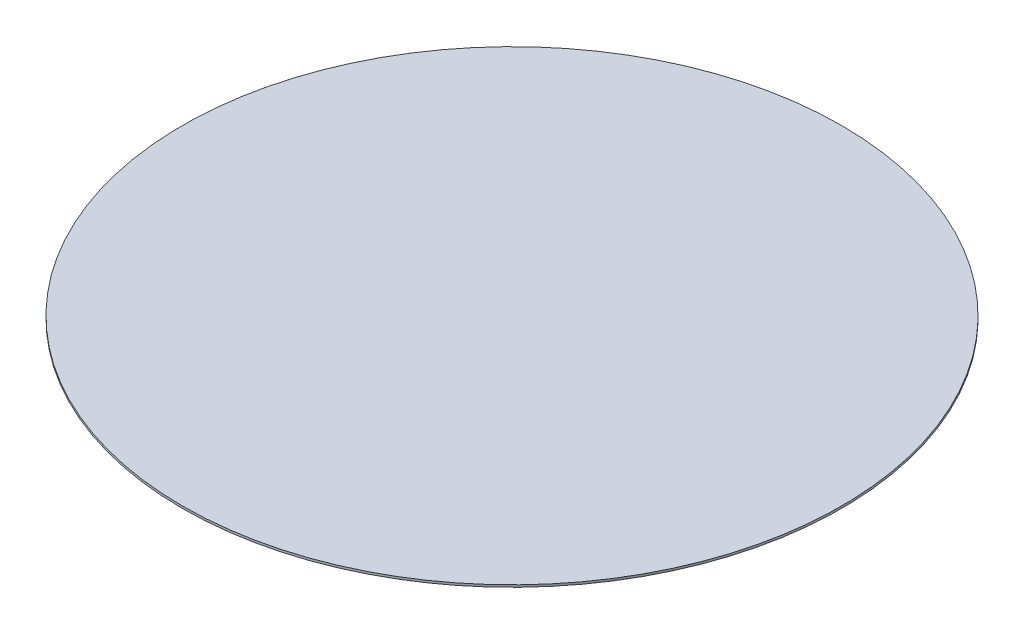
ISO-10303-21;
HEADER;
FILE_DESCRIPTION(('STEP AP214'),'2;1');
FILE_NAME('part.step','',(''),(''),'','','');
FILE_SCHEMA(('AUTOMOTIVE_DESIGN { 1 0 10303 214 1 1 1 1 }'));
ENDSEC;
DATA;
#1=APPLICATION_CONTEXT('core data for automotive mechanical design processes');
#2=APPLICATION_PROTOCOL_DEFINITION('international standard','automotive_design',2000,#1);
#3=PRODUCT_CONTEXT('',#1,'mechanical');
#4=PRODUCT('Part','Part','',(#3));
#5=PRODUCT_RELATED_PRODUCT_CATEGORY('part','',(#4));
#6=PRODUCT_DEFINITION_FORMATION('','',#4);
#7=PRODUCT_DEFINITION_CONTEXT('part definition',#1,'design');
#8=PRODUCT_DEFINITION('design','',#6,#7);
#9=PRODUCT_DEFINITION_SHAPE('','',#8);
#10=(LENGTH_UNIT() NAMED_UNIT(*) SI_UNIT(.MILLI.,.METRE.));
#11=(NAMED_UNIT(*) PLANE_ANGLE_UNIT() SI_UNIT($,.RADIAN.));
#12=(NAMED_UNIT(*) SI_UNIT($,.STERADIAN.) SOLID_ANGLE_UNIT());
#13=UNCERTAINTY_MEASURE_WITH_UNIT(LENGTH_MEASURE(1.E-05),#10,'distance_accuracy_value','');
#14=(GEOMETRIC_REPRESENTATION_CONTEXT(3) GLOBAL_UNCERTAINTY_ASSIGNED_CONTEXT((#13)) GLOBAL_UNIT_ASSIGNED_CONTEXT((#10,
#11,#12)) REPRESENTATION_CONTEXT('',''));
#15=CARTESIAN_POINT('',(0.,0.,0.));
#16=DIRECTION('',(0.,0.,1.));
#17=DIRECTION('',(1.,0.,0.));
#18=AXIS2_PLACEMENT_3D('',#15,#16,#17);
#19=CARTESIAN_POINT('',(0.,1.,0.));
#20=DIRECTION('',(0.,-1.,0.));
#21=DIRECTION('',(0.,0.,-1.));
#22=AXIS2_PLACEMENT_3D('',#19,#20,#21);
#23=CYLINDRICAL_SURFACE('',#22,150.);
#24=CARTESIAN_POINT('',(0.,1.,0.));
#25=DIRECTION('',(0.,1.,0.));
#26=DIRECTION('',(0.,0.,1.));
#27=AXIS2_PLACEMENT_3D('',#24,#25,#26);
#28=CIRCLE('',#27,150.);
#29=CARTESIAN_POINT('',(0.,1.,150.));
#30=VERTEX_POINT('',#29);
#31=EDGE_CURVE('E10',#30,#30,#28,.T.);
#32=ORIENTED_EDGE('',*,*,#31,.F.);
#33=EDGE_LOOP('',(#32));
#34=FACE_BOUND('',#33,.T.);
#35=CARTESIAN_POINT('',(0.,0.,0.));
#36=DIRECTION('',(0.,1.,0.));
#37=DIRECTION('',(0.,0.,1.));
#38=AXIS2_PLACEMENT_3D('',#35,#36,#37);
#39=CIRCLE('',#38,150.);
#40=CARTESIAN_POINT('',(0.,0.,150.));
#41=VERTEX_POINT('',#40);
#42=EDGE_CURVE('E46',#41,#41,#39,.T.);
#43=ORIENTED_EDGE('',*,*,#42,.T.);
#44=EDGE_LOOP('',(#43));
#45=FACE_BOUND('',#44,.T.);
#46=ADVANCED_FACE('F43',(#34,#45),#23,.T.);
#47=CARTESIAN_POINT('',(0.,1.,0.));
#48=DIRECTION('',(0.,1.,0.));
#49=DIRECTION('',(0.,0.,1.));
#50=AXIS2_PLACEMENT_3D('',#47,#48,#49);
#51=PLANE('',#50);
#52=ORIENTED_EDGE('',*,*,#31,.T.);
#53=EDGE_LOOP('',(#52));
#54=FACE_BOUND('',#53,.T.);
#55=ADVANCED_FACE('F60',(#54),#51,.T.);
#56=CARTESIAN_POINT('',(0.,0.,0.));
#57=DIRECTION('',(0.,1.,0.));
#58=DIRECTION('',(0.,0.,1.));
#59=AXIS2_PLACEMENT_3D('',#56,#57,#58);
#60=PLANE('',#59);
#61=ORIENTED_EDGE('',*,*,#42,.F.);
#62=EDGE_LOOP('',(#61));
#63=FACE_BOUND('',#62,.T.);
#64=ADVANCED_FACE('F58',(#63),#60,.F.);
#65=CLOSED_SHELL('',(#46,#55,#64));
#66=MANIFOLD_SOLID_BREP('B2',#65);
#67=ADVANCED_BREP_SHAPE_REPRESENTATION('',(#18,#66),#14);
#68=SHAPE_DEFINITION_REPRESENTATION(#9,#67);
ENDSEC;
END-ISO-10303-21;
